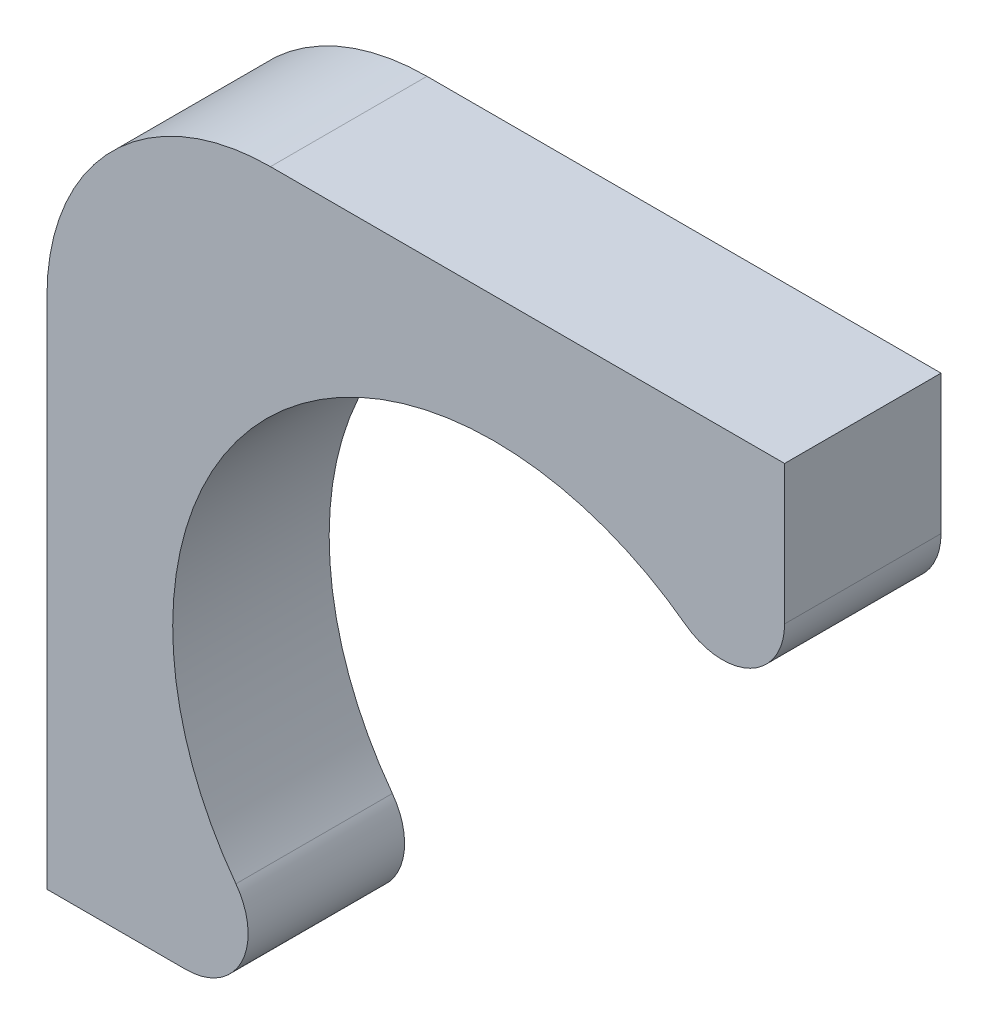
ISO-10303-21;
HEADER;
FILE_DESCRIPTION(('STEP AP214'),'2;1');
FILE_NAME('part.step','',(''),(''),'','','');
FILE_SCHEMA(('AUTOMOTIVE_DESIGN { 1 0 10303 214 1 1 1 1 }'));
ENDSEC;
DATA;
#1=APPLICATION_CONTEXT('core data for automotive mechanical design processes');
#2=APPLICATION_PROTOCOL_DEFINITION('international standard','automotive_design',2000,#1);
#3=PRODUCT_CONTEXT('',#1,'mechanical');
#4=PRODUCT('Part','Part','',(#3));
#5=PRODUCT_RELATED_PRODUCT_CATEGORY('part','',(#4));
#6=PRODUCT_DEFINITION_FORMATION('','',#4);
#7=PRODUCT_DEFINITION_CONTEXT('part definition',#1,'design');
#8=PRODUCT_DEFINITION('design','',#6,#7);
#9=PRODUCT_DEFINITION_SHAPE('','',#8);
#10=(LENGTH_UNIT() NAMED_UNIT(*) SI_UNIT(.MILLI.,.METRE.));
#11=(NAMED_UNIT(*) PLANE_ANGLE_UNIT() SI_UNIT($,.RADIAN.));
#12=(NAMED_UNIT(*) SI_UNIT($,.STERADIAN.) SOLID_ANGLE_UNIT());
#13=UNCERTAINTY_MEASURE_WITH_UNIT(LENGTH_MEASURE(1.E-05),#10,'distance_accuracy_value','');
#14=(GEOMETRIC_REPRESENTATION_CONTEXT(3) GLOBAL_UNCERTAINTY_ASSIGNED_CONTEXT((#13)) GLOBAL_UNIT_ASSIGNED_CONTEXT((#10,
#11,#12)) REPRESENTATION_CONTEXT('',''));
#15=CARTESIAN_POINT('',(0.,0.,0.));
#16=DIRECTION('',(0.,0.,1.));
#17=DIRECTION('',(1.,0.,0.));
#18=AXIS2_PLACEMENT_3D('',#15,#16,#17);
#19=CARTESIAN_POINT('',(-2.75631465594122,-2.04368534405878,1.4));
#20=DIRECTION('',(0.,0.,-1.));
#21=DIRECTION('',(-1.,0.,0.));
#22=AXIS2_PLACEMENT_3D('',#19,#20,#21);
#23=CYLINDRICAL_SURFACE('',#22,0.556314655941221);
#24=CARTESIAN_POINT('',(-2.75631465594122,-2.04368534405878,0.));
#25=DIRECTION('',(0.,0.,1.));
#26=DIRECTION('',(1.,0.,0.));
#27=AXIS2_PLACEMENT_3D('',#24,#25,#26);
#28=CIRCLE('',#27,0.556314655941221);
#29=CARTESIAN_POINT('',(-2.75631465594122,-2.6,0.));
#30=VERTEX_POINT('',#29);
#31=CARTESIAN_POINT('',(-2.30943688656187,-1.7123452534426,0.));
#32=VERTEX_POINT('',#31);
#33=EDGE_CURVE('E129',#30,#32,#28,.T.);
#34=ORIENTED_EDGE('',*,*,#33,.T.);
#35=DIRECTION('',(0.,0.,-1.));
#36=VECTOR('',#35,1.);
#37=CARTESIAN_POINT('',(-2.30943688656187,-1.7123452534426,1.4));
#38=LINE('',#37,#36);
#39=CARTESIAN_POINT('',(-2.30943688656187,-1.7123452534426,1.4));
#40=VERTEX_POINT('',#39);
#41=EDGE_CURVE('E11',#40,#32,#38,.T.);
#42=ORIENTED_EDGE('',*,*,#41,.F.);
#43=CARTESIAN_POINT('',(-2.75631465594122,-2.04368534405878,1.4));
#44=DIRECTION('',(0.,0.,1.));
#45=DIRECTION('',(1.,0.,0.));
#46=AXIS2_PLACEMENT_3D('',#43,#44,#45);
#47=CIRCLE('',#46,0.556314655941221);
#48=CARTESIAN_POINT('',(-2.75631465594122,-2.6,1.4));
#49=VERTEX_POINT('',#48);
#50=EDGE_CURVE('E143',#49,#40,#47,.T.);
#51=ORIENTED_EDGE('',*,*,#50,.F.);
#52=DIRECTION('',(0.,0.,-1.));
#53=VECTOR('',#52,1.);
#54=CARTESIAN_POINT('',(-2.75631465594122,-2.6,1.4));
#55=LINE('',#54,#53);
#56=EDGE_CURVE('E125',#49,#30,#55,.T.);
#57=ORIENTED_EDGE('',*,*,#56,.T.);
#58=EDGE_LOOP('',(#34,#42,#51,#57));
#59=FACE_BOUND('',#58,.T.);
#60=ADVANCED_FACE('F33',(#59),#23,.T.);
#61=CARTESIAN_POINT('',(0.,0.,1.4));
#62=DIRECTION('',(0.,0.,-1.));
#63=DIRECTION('',(-1.,0.,0.));
#64=AXIS2_PLACEMENT_3D('',#61,#62,#63);
#65=CYLINDRICAL_SURFACE('',#64,2.875);
#66=CARTESIAN_POINT('',(0.,0.,0.));
#67=DIRECTION('',(0.,0.,-1.));
#68=DIRECTION('',(-1.,0.,0.));
#69=AXIS2_PLACEMENT_3D('',#66,#67,#68);
#70=CIRCLE('',#69,2.875);
#71=CARTESIAN_POINT('',(1.7123452534426,2.30943688656187,0.));
#72=VERTEX_POINT('',#71);
#73=EDGE_CURVE('E132',#32,#72,#70,.T.);
#74=ORIENTED_EDGE('',*,*,#73,.T.);
#75=DIRECTION('',(0.,0.,-1.));
#76=VECTOR('',#75,1.);
#77=CARTESIAN_POINT('',(1.7123452534426,2.30943688656187,1.4));
#78=LINE('',#77,#76);
#79=CARTESIAN_POINT('',(1.7123452534426,2.30943688656187,1.4));
#80=VERTEX_POINT('',#79);
#81=EDGE_CURVE('E41',#80,#72,#78,.T.);
#82=ORIENTED_EDGE('',*,*,#81,.F.);
#83=CARTESIAN_POINT('',(0.,0.,1.4));
#84=DIRECTION('',(0.,0.,-1.));
#85=DIRECTION('',(-1.,0.,0.));
#86=AXIS2_PLACEMENT_3D('',#83,#84,#85);
#87=CIRCLE('',#86,2.875);
#88=EDGE_CURVE('E92',#40,#80,#87,.T.);
#89=ORIENTED_EDGE('',*,*,#88,.F.);
#90=ORIENTED_EDGE('',*,*,#41,.T.);
#91=EDGE_LOOP('',(#74,#82,#89,#90));
#92=FACE_BOUND('',#91,.T.);
#93=ADVANCED_FACE('F178',(#92),#65,.F.);
#94=CARTESIAN_POINT('',(2.04368534405878,2.75631465594122,1.4));
#95=DIRECTION('',(0.,0.,-1.));
#96=DIRECTION('',(-1.,0.,0.));
#97=AXIS2_PLACEMENT_3D('',#94,#95,#96);
#98=CYLINDRICAL_SURFACE('',#97,0.556314655941221);
#99=CARTESIAN_POINT('',(2.04368534405878,2.75631465594122,0.));
#100=DIRECTION('',(0.,0.,1.));
#101=DIRECTION('',(-1.,0.,0.));
#102=AXIS2_PLACEMENT_3D('',#99,#100,#101);
#103=CIRCLE('',#102,0.556314655941221);
#104=CARTESIAN_POINT('',(2.6,2.75631465594122,0.));
#105=VERTEX_POINT('',#104);
#106=EDGE_CURVE('E134',#72,#105,#103,.T.);
#107=ORIENTED_EDGE('',*,*,#106,.T.);
#108=DIRECTION('',(0.,0.,-1.));
#109=VECTOR('',#108,1.);
#110=CARTESIAN_POINT('',(2.6,2.75631465594122,1.4));
#111=LINE('',#110,#109);
#112=CARTESIAN_POINT('',(2.6,2.75631465594122,1.4));
#113=VERTEX_POINT('',#112);
#114=EDGE_CURVE('E150',#113,#105,#111,.T.);
#115=ORIENTED_EDGE('',*,*,#114,.F.);
#116=CARTESIAN_POINT('',(2.04368534405878,2.75631465594122,1.4));
#117=DIRECTION('',(0.,0.,1.));
#118=DIRECTION('',(-1.,0.,0.));
#119=AXIS2_PLACEMENT_3D('',#116,#117,#118);
#120=CIRCLE('',#119,0.556314655941221);
#121=EDGE_CURVE('E158',#80,#113,#120,.T.);
#122=ORIENTED_EDGE('',*,*,#121,.F.);
#123=ORIENTED_EDGE('',*,*,#81,.T.);
#124=EDGE_LOOP('',(#107,#115,#122,#123));
#125=FACE_BOUND('',#124,.T.);
#126=ADVANCED_FACE('F156',(#125),#98,.T.);
#127=CARTESIAN_POINT('',(2.6,4.,1.4));
#128=DIRECTION('',(-1.,0.,0.));
#129=DIRECTION('',(0.,-1.,0.));
#130=AXIS2_PLACEMENT_3D('',#127,#128,#129);
#131=PLANE('',#130);
#132=DIRECTION('',(0.,1.,0.));
#133=VECTOR('',#132,1.);
#134=CARTESIAN_POINT('',(2.6,4.,0.));
#135=LINE('',#134,#133);
#136=CARTESIAN_POINT('',(2.6,4.,0.));
#137=VERTEX_POINT('',#136);
#138=EDGE_CURVE('E136',#105,#137,#135,.T.);
#139=ORIENTED_EDGE('',*,*,#138,.T.);
#140=DIRECTION('',(0.,0.,-1.));
#141=VECTOR('',#140,1.);
#142=CARTESIAN_POINT('',(2.6,4.,1.4));
#143=LINE('',#142,#141);
#144=CARTESIAN_POINT('',(2.6,4.,1.4));
#145=VERTEX_POINT('',#144);
#146=EDGE_CURVE('E147',#145,#137,#143,.T.);
#147=ORIENTED_EDGE('',*,*,#146,.F.);
#148=DIRECTION('',(0.,1.,0.));
#149=VECTOR('',#148,1.);
#150=CARTESIAN_POINT('',(2.6,4.,1.4));
#151=LINE('',#150,#149);
#152=EDGE_CURVE('E170',#113,#145,#151,.T.);
#153=ORIENTED_EDGE('',*,*,#152,.F.);
#154=ORIENTED_EDGE('',*,*,#114,.T.);
#155=EDGE_LOOP('',(#139,#147,#153,#154));
#156=FACE_BOUND('',#155,.T.);
#157=ADVANCED_FACE('F166',(#156),#131,.F.);
#158=CARTESIAN_POINT('',(2.6,4.,1.4));
#159=DIRECTION('',(0.,-1.,0.));
#160=DIRECTION('',(1.,0.,0.));
#161=AXIS2_PLACEMENT_3D('',#158,#159,#160);
#162=PLANE('',#161);
#163=DIRECTION('',(-1.,0.,0.));
#164=VECTOR('',#163,1.);
#165=CARTESIAN_POINT('',(2.6,4.,0.));
#166=LINE('',#165,#164);
#167=CARTESIAN_POINT('',(-1.99999999999999,4.,0.));
#168=VERTEX_POINT('',#167);
#169=EDGE_CURVE('E138',#137,#168,#166,.T.);
#170=ORIENTED_EDGE('',*,*,#169,.T.);
#171=DIRECTION('',(0.,0.,-1.));
#172=VECTOR('',#171,1.);
#173=CARTESIAN_POINT('',(-1.99999999999999,4.,1.4));
#174=LINE('',#173,#172);
#175=CARTESIAN_POINT('',(-1.99999999999999,4.,1.4));
#176=VERTEX_POINT('',#175);
#177=EDGE_CURVE('E120',#176,#168,#174,.T.);
#178=ORIENTED_EDGE('',*,*,#177,.F.);
#179=DIRECTION('',(-1.,0.,0.));
#180=VECTOR('',#179,1.);
#181=CARTESIAN_POINT('',(2.6,4.,1.4));
#182=LINE('',#181,#180);
#183=EDGE_CURVE('E111',#145,#176,#182,.T.);
#184=ORIENTED_EDGE('',*,*,#183,.F.);
#185=ORIENTED_EDGE('',*,*,#146,.T.);
#186=EDGE_LOOP('',(#170,#178,#184,#185));
#187=FACE_BOUND('',#186,.T.);
#188=ADVANCED_FACE('F169',(#187),#162,.F.);
#189=CARTESIAN_POINT('',(-2.,2.,1.4));
#190=DIRECTION('',(0.,0.,-1.));
#191=DIRECTION('',(-1.,0.,0.));
#192=AXIS2_PLACEMENT_3D('',#189,#190,#191);
#193=CYLINDRICAL_SURFACE('',#192,2.);
#194=CARTESIAN_POINT('',(-2.,2.,0.));
#195=DIRECTION('',(0.,0.,1.));
#196=DIRECTION('',(1.,0.,0.));
#197=AXIS2_PLACEMENT_3D('',#194,#195,#196);
#198=CIRCLE('',#197,2.);
#199=CARTESIAN_POINT('',(-4.,1.99999999999999,0.));
#200=VERTEX_POINT('',#199);
#201=EDGE_CURVE('E119',#168,#200,#198,.T.);
#202=ORIENTED_EDGE('',*,*,#201,.T.);
#203=DIRECTION('',(0.,0.,-1.));
#204=VECTOR('',#203,1.);
#205=CARTESIAN_POINT('',(-4.,1.99999999999999,1.4));
#206=LINE('',#205,#204);
#207=CARTESIAN_POINT('',(-4.,1.99999999999999,1.4));
#208=VERTEX_POINT('',#207);
#209=EDGE_CURVE('E116',#208,#200,#206,.T.);
#210=ORIENTED_EDGE('',*,*,#209,.F.);
#211=CARTESIAN_POINT('',(-2.,2.,1.4));
#212=DIRECTION('',(0.,0.,1.));
#213=DIRECTION('',(1.,0.,0.));
#214=AXIS2_PLACEMENT_3D('',#211,#212,#213);
#215=CIRCLE('',#214,2.);
#216=EDGE_CURVE('E105',#176,#208,#215,.T.);
#217=ORIENTED_EDGE('',*,*,#216,.F.);
#218=ORIENTED_EDGE('',*,*,#177,.T.);
#219=EDGE_LOOP('',(#202,#210,#217,#218));
#220=FACE_BOUND('',#219,.T.);
#221=ADVANCED_FACE('F117',(#220),#193,.T.);
#222=CARTESIAN_POINT('',(-4.,1.99999999999998,1.4));
#223=DIRECTION('',(1.,0.,0.));
#224=DIRECTION('',(0.,0.,-1.));
#225=AXIS2_PLACEMENT_3D('',#222,#223,#224);
#226=PLANE('',#225);
#227=DIRECTION('',(0.,-1.,0.));
#228=VECTOR('',#227,1.);
#229=CARTESIAN_POINT('',(-4.,1.99999999999998,0.));
#230=LINE('',#229,#228);
#231=CARTESIAN_POINT('',(-4.,-2.6,0.));
#232=VERTEX_POINT('',#231);
#233=EDGE_CURVE('E78',#200,#232,#230,.T.);
#234=ORIENTED_EDGE('',*,*,#233,.T.);
#235=DIRECTION('',(0.,0.,-1.));
#236=VECTOR('',#235,1.);
#237=CARTESIAN_POINT('',(-4.,-2.6,1.4));
#238=LINE('',#237,#236);
#239=CARTESIAN_POINT('',(-4.,-2.6,1.4));
#240=VERTEX_POINT('',#239);
#241=EDGE_CURVE('E121',#240,#232,#238,.T.);
#242=ORIENTED_EDGE('',*,*,#241,.F.);
#243=DIRECTION('',(0.,-1.,0.));
#244=VECTOR('',#243,1.);
#245=CARTESIAN_POINT('',(-4.,1.99999999999998,1.4));
#246=LINE('',#245,#244);
#247=EDGE_CURVE('E109',#208,#240,#246,.T.);
#248=ORIENTED_EDGE('',*,*,#247,.F.);
#249=ORIENTED_EDGE('',*,*,#209,.T.);
#250=EDGE_LOOP('',(#234,#242,#248,#249));
#251=FACE_BOUND('',#250,.T.);
#252=ADVANCED_FACE('F123',(#251),#226,.F.);
#253=CARTESIAN_POINT('',(-4.,-2.6,1.4));
#254=DIRECTION('',(0.,1.,0.));
#255=DIRECTION('',(0.,0.,1.));
#256=AXIS2_PLACEMENT_3D('',#253,#254,#255);
#257=PLANE('',#256);
#258=DIRECTION('',(1.,0.,0.));
#259=VECTOR('',#258,1.);
#260=CARTESIAN_POINT('',(-4.,-2.6,0.));
#261=LINE('',#260,#259);
#262=EDGE_CURVE('E84',#232,#30,#261,.T.);
#263=ORIENTED_EDGE('',*,*,#262,.T.);
#264=ORIENTED_EDGE('',*,*,#56,.F.);
#265=DIRECTION('',(1.,0.,0.));
#266=VECTOR('',#265,1.);
#267=CARTESIAN_POINT('',(-4.,-2.6,1.4));
#268=LINE('',#267,#266);
#269=EDGE_CURVE('E49',#240,#49,#268,.T.);
#270=ORIENTED_EDGE('',*,*,#269,.F.);
#271=ORIENTED_EDGE('',*,*,#241,.T.);
#272=EDGE_LOOP('',(#263,#264,#270,#271));
#273=FACE_BOUND('',#272,.T.);
#274=ADVANCED_FACE('F194',(#273),#257,.F.);
#275=CARTESIAN_POINT('',(-2.75631465594122,-2.04368534405878,1.4));
#276=DIRECTION('',(0.,0.,1.));
#277=DIRECTION('',(1.,0.,0.));
#278=AXIS2_PLACEMENT_3D('',#275,#276,#277);
#279=PLANE('',#278);
#280=ORIENTED_EDGE('',*,*,#50,.T.);
#281=ORIENTED_EDGE('',*,*,#88,.T.);
#282=ORIENTED_EDGE('',*,*,#121,.T.);
#283=ORIENTED_EDGE('',*,*,#152,.T.);
#284=ORIENTED_EDGE('',*,*,#183,.T.);
#285=ORIENTED_EDGE('',*,*,#216,.T.);
#286=ORIENTED_EDGE('',*,*,#247,.T.);
#287=ORIENTED_EDGE('',*,*,#269,.T.);
#288=EDGE_LOOP('',(#280,#281,#282,#283,#284,#285,#286,#287));
#289=FACE_BOUND('',#288,.T.);
#290=ADVANCED_FACE('F107',(#289),#279,.T.);
#291=CARTESIAN_POINT('',(-2.75631465594122,-2.04368534405878,0.));
#292=DIRECTION('',(0.,0.,1.));
#293=DIRECTION('',(1.,0.,0.));
#294=AXIS2_PLACEMENT_3D('',#291,#292,#293);
#295=PLANE('',#294);
#296=ORIENTED_EDGE('',*,*,#33,.F.);
#297=ORIENTED_EDGE('',*,*,#262,.F.);
#298=ORIENTED_EDGE('',*,*,#233,.F.);
#299=ORIENTED_EDGE('',*,*,#201,.F.);
#300=ORIENTED_EDGE('',*,*,#169,.F.);
#301=ORIENTED_EDGE('',*,*,#138,.F.);
#302=ORIENTED_EDGE('',*,*,#106,.F.);
#303=ORIENTED_EDGE('',*,*,#73,.F.);
#304=EDGE_LOOP('',(#296,#297,#298,#299,#300,#301,#302,#303));
#305=FACE_BOUND('',#304,.T.);
#306=ADVANCED_FACE('F162',(#305),#295,.F.);
#307=CLOSED_SHELL('',(#60,#93,#126,#157,#188,#221,#252,#274,#290,#306));
#308=MANIFOLD_SOLID_BREP('B2',#307);
#309=ADVANCED_BREP_SHAPE_REPRESENTATION('',(#18,#308),#14);
#310=SHAPE_DEFINITION_REPRESENTATION(#9,#309);
ENDSEC;
END-ISO-10303-21;
